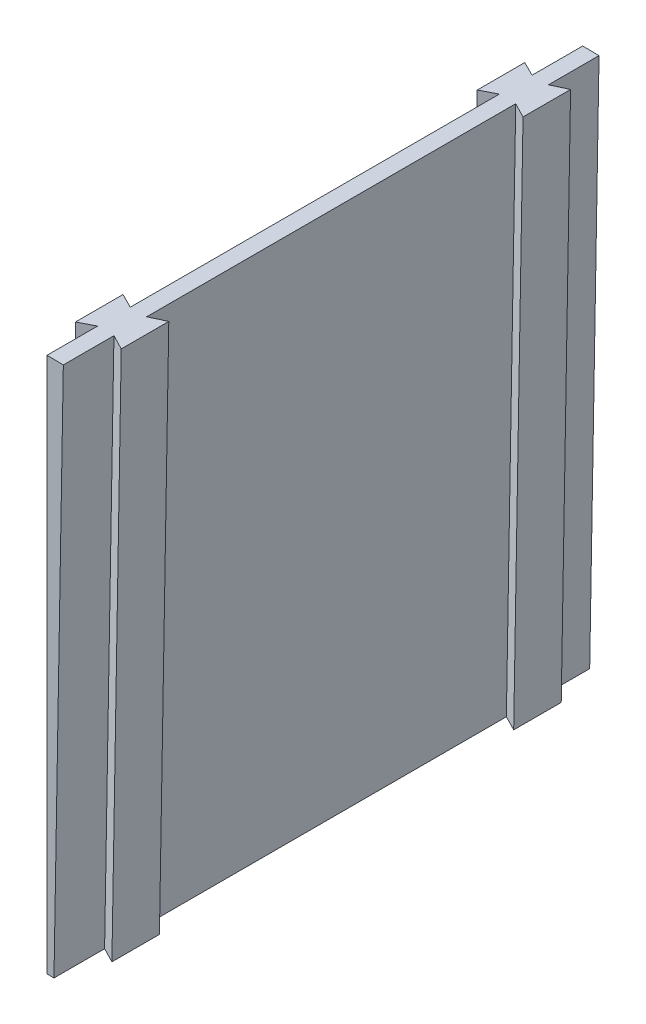
ISO-10303-21;
HEADER;
FILE_DESCRIPTION(('STEP AP214'),'2;1');
FILE_NAME('part.step','',(''),(''),'','','');
FILE_SCHEMA(('AUTOMOTIVE_DESIGN { 1 0 10303 214 1 1 1 1 }'));
ENDSEC;
DATA;
#1=APPLICATION_CONTEXT('core data for automotive mechanical design processes');
#2=APPLICATION_PROTOCOL_DEFINITION('international standard','automotive_design',2000,#1);
#3=PRODUCT_CONTEXT('',#1,'mechanical');
#4=PRODUCT('Part','Part','',(#3));
#5=PRODUCT_RELATED_PRODUCT_CATEGORY('part','',(#4));
#6=PRODUCT_DEFINITION_FORMATION('','',#4);
#7=PRODUCT_DEFINITION_CONTEXT('part definition',#1,'design');
#8=PRODUCT_DEFINITION('design','',#6,#7);
#9=PRODUCT_DEFINITION_SHAPE('','',#8);
#10=(LENGTH_UNIT() NAMED_UNIT(*) SI_UNIT(.MILLI.,.METRE.));
#11=(NAMED_UNIT(*) PLANE_ANGLE_UNIT() SI_UNIT($,.RADIAN.));
#12=(NAMED_UNIT(*) SI_UNIT($,.STERADIAN.) SOLID_ANGLE_UNIT());
#13=UNCERTAINTY_MEASURE_WITH_UNIT(LENGTH_MEASURE(1.E-05),#10,'distance_accuracy_value','');
#14=(GEOMETRIC_REPRESENTATION_CONTEXT(3) GLOBAL_UNCERTAINTY_ASSIGNED_CONTEXT((#13)) GLOBAL_UNIT_ASSIGNED_CONTEXT((#10,
#11,#12)) REPRESENTATION_CONTEXT('',''));
#15=CARTESIAN_POINT('',(0.,0.,0.));
#16=DIRECTION('',(0.,0.,1.));
#17=DIRECTION('',(1.,0.,0.));
#18=AXIS2_PLACEMENT_3D('',#15,#16,#17);
#19=CARTESIAN_POINT('',(0.,76.2,101.6));
#20=DIRECTION('',(1.,0.,0.));
#21=DIRECTION('',(0.,0.,-1.));
#22=AXIS2_PLACEMENT_3D('',#19,#20,#21);
#23=PLANE('',#22);
#24=DIRECTION('',(0.,0.,-1.));
#25=VECTOR('',#24,1.);
#26=CARTESIAN_POINT('',(0.,177.8,101.6));
#27=LINE('',#26,#25);
#28=CARTESIAN_POINT('',(0.,177.8,85.7997919351432));
#29=VERTEX_POINT('',#28);
#30=CARTESIAN_POINT('',(0.,177.8,15.8002080648568));
#31=VERTEX_POINT('',#30);
#32=EDGE_CURVE('E191',#29,#31,#27,.T.);
#33=ORIENTED_EDGE('',*,*,#32,.T.);
#34=DIRECTION('',(0.,-1.,0.));
#35=VECTOR('',#34,1.);
#36=CARTESIAN_POINT('',(0.,177.801,15.8002080648568));
#37=LINE('',#36,#35);
#38=CARTESIAN_POINT('',(0.,76.2,15.8002080648568));
#39=VERTEX_POINT('',#38);
#40=EDGE_CURVE('E68',#31,#39,#37,.T.);
#41=ORIENTED_EDGE('',*,*,#40,.T.);
#42=DIRECTION('',(0.,0.,-1.));
#43=VECTOR('',#42,1.);
#44=CARTESIAN_POINT('',(0.,76.2,101.6));
#45=LINE('',#44,#43);
#46=CARTESIAN_POINT('',(0.,76.2,85.7997919351432));
#47=VERTEX_POINT('',#46);
#48=EDGE_CURVE('E363',#47,#39,#45,.T.);
#49=ORIENTED_EDGE('',*,*,#48,.F.);
#50=DIRECTION('',(0.,-1.,0.));
#51=VECTOR('',#50,1.);
#52=CARTESIAN_POINT('',(0.,177.801,85.7997919351432));
#53=LINE('',#52,#51);
#54=EDGE_CURVE('E221',#29,#47,#53,.T.);
#55=ORIENTED_EDGE('',*,*,#54,.F.);
#56=EDGE_LOOP('',(#33,#41,#49,#55));
#57=FACE_BOUND('',#56,.T.);
#58=ADVANCED_FACE('F43',(#57),#23,.F.);
#59=CARTESIAN_POINT('',(0.,76.2,9.59979193514321));
#60=VERTEX_POINT('',#59);
#61=CARTESIAN_POINT('',(0.,76.2,0.));
#62=VERTEX_POINT('',#61);
#63=EDGE_CURVE('E60',#60,#62,#45,.T.);
#64=ORIENTED_EDGE('',*,*,#63,.F.);
#65=DIRECTION('',(0.,-1.,0.));
#66=VECTOR('',#65,1.);
#67=CARTESIAN_POINT('',(0.,177.801,9.59979193514321));
#68=LINE('',#67,#66);
#69=CARTESIAN_POINT('',(0.,177.8,9.59979193514321));
#70=VERTEX_POINT('',#69);
#71=EDGE_CURVE('E196',#70,#60,#68,.T.);
#72=ORIENTED_EDGE('',*,*,#71,.F.);
#73=CARTESIAN_POINT('',(0.,177.8,0.));
#74=VERTEX_POINT('',#73);
#75=EDGE_CURVE('E182',#70,#74,#27,.T.);
#76=ORIENTED_EDGE('',*,*,#75,.T.);
#77=DIRECTION('',(0.,-1.,0.));
#78=VECTOR('',#77,1.);
#79=CARTESIAN_POINT('',(0.,76.2,0.));
#80=LINE('',#79,#78);
#81=EDGE_CURVE('E341',#74,#62,#80,.T.);
#82=ORIENTED_EDGE('',*,*,#81,.T.);
#83=EDGE_LOOP('',(#64,#72,#76,#82));
#84=FACE_BOUND('',#83,.T.);
#85=ADVANCED_FACE('F197',(#84),#23,.F.);
#86=CARTESIAN_POINT('',(1.32987337052101,76.188394370917,101.6));
#87=DIRECTION('',(-0.999847695156391,0.0174524064372835,0.));
#88=DIRECTION('',(-0.0174524064372835,-0.999847695156391,0.));
#89=AXIS2_PLACEMENT_3D('',#86,#87,#88);
#90=PLANE('',#89);
#91=DIRECTION('',(0.,0.,-1.));
#92=VECTOR('',#91,1.);
#93=CARTESIAN_POINT('',(1.32987337052101,76.188394370917,101.6));
#94=LINE('',#93,#92);
#95=CARTESIAN_POINT('',(1.32987337052101,76.188394370917,85.7997919351432));
#96=VERTEX_POINT('',#95);
#97=CARTESIAN_POINT('',(1.32987337052101,76.1883943709171,15.8002080648568));
#98=VERTEX_POINT('',#97);
#99=EDGE_CURVE('E52',#96,#98,#94,.T.);
#100=ORIENTED_EDGE('',*,*,#99,.T.);
#101=DIRECTION('',(-0.0174524064372835,-0.999847695156391,0.));
#102=VECTOR('',#101,1.);
#103=CARTESIAN_POINT('',(3.10388874955414,177.821667368102,15.8002080648568));
#104=LINE('',#103,#102);
#105=CARTESIAN_POINT('',(3.10303786454902,177.772920198806,15.8002080648568));
#106=VERTEX_POINT('',#105);
#107=EDGE_CURVE('E258',#106,#98,#104,.T.);
#108=ORIENTED_EDGE('',*,*,#107,.F.);
#109=DIRECTION('',(0.,0.,-1.));
#110=VECTOR('',#109,1.);
#111=CARTESIAN_POINT('',(3.103037864549,177.772920198806,101.6));
#112=LINE('',#111,#110);
#113=CARTESIAN_POINT('',(3.103037864549,177.772920198806,85.7997919351432));
#114=VERTEX_POINT('',#113);
#115=EDGE_CURVE('E369',#114,#106,#112,.T.);
#116=ORIENTED_EDGE('',*,*,#115,.F.);
#117=DIRECTION('',(-0.0174524064372835,-0.999847695156391,0.));
#118=VECTOR('',#117,1.);
#119=CARTESIAN_POINT('',(3.10388874955414,177.821667368102,85.7997919351432));
#120=LINE('',#119,#118);
#121=EDGE_CURVE('E320',#114,#96,#120,.T.);
#122=ORIENTED_EDGE('',*,*,#121,.T.);
#123=EDGE_LOOP('',(#100,#108,#116,#122));
#124=FACE_BOUND('',#123,.T.);
#125=ADVANCED_FACE('F470',(#124),#90,.F.);
#126=DIRECTION('',(-0.0174524064372835,-0.999847695156391,0.));
#127=VECTOR('',#126,1.);
#128=CARTESIAN_POINT('',(3.10388874955414,177.821667368102,92.0002080648568));
#129=LINE('',#128,#127);
#130=CARTESIAN_POINT('',(3.103037864549,177.772920198806,92.0002080648568));
#131=VERTEX_POINT('',#130);
#132=CARTESIAN_POINT('',(1.32987337052101,76.1883943709171,92.0002080648568));
#133=VERTEX_POINT('',#132);
#134=EDGE_CURVE('E301',#131,#133,#129,.T.);
#135=ORIENTED_EDGE('',*,*,#134,.F.);
#136=CARTESIAN_POINT('',(3.103037864549,177.772920198806,101.6));
#137=VERTEX_POINT('',#136);
#138=EDGE_CURVE('E366',#137,#131,#112,.T.);
#139=ORIENTED_EDGE('',*,*,#138,.F.);
#140=DIRECTION('',(0.0174524064372835,0.999847695156391,0.));
#141=VECTOR('',#140,1.);
#142=CARTESIAN_POINT('',(1.32987337052101,76.188394370917,101.6));
#143=LINE('',#142,#141);
#144=CARTESIAN_POINT('',(1.32987337052101,76.188394370917,101.6));
#145=VERTEX_POINT('',#144);
#146=EDGE_CURVE('E340',#145,#137,#143,.T.);
#147=ORIENTED_EDGE('',*,*,#146,.F.);
#148=EDGE_CURVE('E11',#145,#133,#94,.T.);
#149=ORIENTED_EDGE('',*,*,#148,.T.);
#150=EDGE_LOOP('',(#135,#139,#147,#149));
#151=FACE_BOUND('',#150,.T.);
#152=ADVANCED_FACE('F449',(#151),#90,.F.);
#153=CARTESIAN_POINT('',(0.,0.,101.6));
#154=DIRECTION('',(0.,0.,-1.));
#155=DIRECTION('',(-1.,0.,0.));
#156=AXIS2_PLACEMENT_3D('',#153,#154,#155);
#157=CYLINDRICAL_SURFACE('',#156,76.2);
#158=CARTESIAN_POINT('',(0.,0.,0.));
#159=DIRECTION('',(0.,0.,-1.));
#160=DIRECTION('',(-1.,0.,0.));
#161=AXIS2_PLACEMENT_3D('',#158,#159,#160);
#162=CIRCLE('',#161,76.2);
#163=CARTESIAN_POINT('',(1.32987337052101,76.188394370917,0.));
#164=VERTEX_POINT('',#163);
#165=EDGE_CURVE('E335',#62,#164,#162,.T.);
#166=ORIENTED_EDGE('',*,*,#165,.T.);
#167=CARTESIAN_POINT('',(1.32987337052101,76.1883943709171,9.59979193514321));
#168=VERTEX_POINT('',#167);
#169=EDGE_CURVE('E53',#168,#164,#94,.T.);
#170=ORIENTED_EDGE('',*,*,#169,.F.);
#171=DIRECTION('',(0.,0.,-1.));
#172=VECTOR('',#171,1.);
#173=CARTESIAN_POINT('',(1.32987337052101,76.1883943709171,15.8002080648568));
#174=LINE('',#173,#172);
#175=EDGE_CURVE('E280',#98,#168,#174,.T.);
#176=ORIENTED_EDGE('',*,*,#175,.F.);
#177=ORIENTED_EDGE('',*,*,#99,.F.);
#178=DIRECTION('',(0.,0.,-1.));
#179=VECTOR('',#178,1.);
#180=CARTESIAN_POINT('',(1.32987337052101,76.1883943709171,85.7997919351432));
#181=LINE('',#180,#179);
#182=EDGE_CURVE('E288',#133,#96,#181,.T.);
#183=ORIENTED_EDGE('',*,*,#182,.F.);
#184=ORIENTED_EDGE('',*,*,#148,.F.);
#185=CARTESIAN_POINT('',(0.,0.,101.6));
#186=DIRECTION('',(0.,0.,-1.));
#187=DIRECTION('',(-1.,0.,0.));
#188=AXIS2_PLACEMENT_3D('',#185,#186,#187);
#189=CIRCLE('',#188,76.2);
#190=CARTESIAN_POINT('',(0.,76.2,101.6));
#191=VERTEX_POINT('',#190);
#192=EDGE_CURVE('E336',#191,#145,#189,.T.);
#193=ORIENTED_EDGE('',*,*,#192,.F.);
#194=CARTESIAN_POINT('',(0.,76.2,92.0002080648568));
#195=VERTEX_POINT('',#194);
#196=EDGE_CURVE('E192',#191,#195,#45,.T.);
#197=ORIENTED_EDGE('',*,*,#196,.T.);
#198=DIRECTION('',(0.,0.,1.));
#199=VECTOR('',#198,1.);
#200=CARTESIAN_POINT('',(0.,76.2,85.7997919351432));
#201=LINE('',#200,#199);
#202=EDGE_CURVE('E225',#47,#195,#201,.T.);
#203=ORIENTED_EDGE('',*,*,#202,.F.);
#204=ORIENTED_EDGE('',*,*,#48,.T.);
#205=DIRECTION('',(0.,0.,1.));
#206=VECTOR('',#205,1.);
#207=CARTESIAN_POINT('',(0.,76.2,15.8002080648568));
#208=LINE('',#207,#206);
#209=EDGE_CURVE('E389',#60,#39,#208,.T.);
#210=ORIENTED_EDGE('',*,*,#209,.F.);
#211=ORIENTED_EDGE('',*,*,#63,.T.);
#212=EDGE_LOOP('',(#166,#170,#176,#177,#183,#184,#193,#197,#203,#204,#210,#211));
#213=FACE_BOUND('',#212,.T.);
#214=ADVANCED_FACE('F45',(#213),#157,.F.);
#215=CARTESIAN_POINT('',(3.103037864549,177.772920198806,9.59979193514321));
#216=VERTEX_POINT('',#215);
#217=CARTESIAN_POINT('',(3.103037864549,177.772920198806,0.));
#218=VERTEX_POINT('',#217);
#219=EDGE_CURVE('E365',#216,#218,#112,.T.);
#220=ORIENTED_EDGE('',*,*,#219,.F.);
#221=DIRECTION('',(-0.0174524064372835,-0.999847695156391,0.));
#222=VECTOR('',#221,1.);
#223=CARTESIAN_POINT('',(3.10388874955414,177.821667368102,9.59979193514321));
#224=LINE('',#223,#222);
#225=EDGE_CURVE('E262',#216,#168,#224,.T.);
#226=ORIENTED_EDGE('',*,*,#225,.T.);
#227=ORIENTED_EDGE('',*,*,#169,.T.);
#228=DIRECTION('',(0.0174524064372835,0.999847695156391,0.));
#229=VECTOR('',#228,1.);
#230=CARTESIAN_POINT('',(1.32987337052101,76.188394370917,0.));
#231=LINE('',#230,#229);
#232=EDGE_CURVE('E353',#164,#218,#231,.T.);
#233=ORIENTED_EDGE('',*,*,#232,.T.);
#234=EDGE_LOOP('',(#220,#226,#227,#233));
#235=FACE_BOUND('',#234,.T.);
#236=ADVANCED_FACE('F381',(#235),#90,.F.);
#237=CARTESIAN_POINT('',(0.,0.,101.6));
#238=DIRECTION('',(0.,0.,-1.));
#239=DIRECTION('',(-1.,0.,0.));
#240=AXIS2_PLACEMENT_3D('',#237,#238,#239);
#241=CYLINDRICAL_SURFACE('',#240,177.8);
#242=CARTESIAN_POINT('',(0.,0.,0.));
#243=DIRECTION('',(0.,0.,1.));
#244=DIRECTION('',(-1.,0.,0.));
#245=AXIS2_PLACEMENT_3D('',#242,#243,#244);
#246=CIRCLE('',#245,177.8);
#247=EDGE_CURVE('E188',#218,#74,#246,.T.);
#248=ORIENTED_EDGE('',*,*,#247,.T.);
#249=ORIENTED_EDGE('',*,*,#75,.F.);
#250=CARTESIAN_POINT('',(0.,0.,9.59979193514321));
#251=DIRECTION('',(0.450153111117083,0.,-0.892951385323754));
#252=DIRECTION('',(-0.892951385323754,0.,-0.450153111117083));
#253=AXIS2_PLACEMENT_3D('',#250,#251,#252);
#254=ELLIPSE('',#253,199.114983102396,177.8);
#255=CARTESIAN_POINT('',(-2.79357446026696,177.778052474806,8.1915));
#256=VERTEX_POINT('',#255);
#257=EDGE_CURVE('E185',#70,#256,#254,.F.);
#258=ORIENTED_EDGE('',*,*,#257,.T.);
#259=DIRECTION('',(0.,0.,-1.));
#260=VECTOR('',#259,1.);
#261=CARTESIAN_POINT('',(-2.79357446026696,177.778052474806,101.6));
#262=LINE('',#261,#260);
#263=CARTESIAN_POINT('',(-2.79357446026696,177.778052474806,17.2085));
#264=VERTEX_POINT('',#263);
#265=EDGE_CURVE('E213',#256,#264,#262,.F.);
#266=ORIENTED_EDGE('',*,*,#265,.T.);
#267=CARTESIAN_POINT('',(0.,0.,15.8002080648568));
#268=DIRECTION('',(0.450153111117083,0.,0.892951385323754));
#269=DIRECTION('',(0.892951385323754,0.,-0.450153111117083));
#270=AXIS2_PLACEMENT_3D('',#267,#268,#269);
#271=ELLIPSE('',#270,199.114983102396,177.8);
#272=EDGE_CURVE('E207',#264,#31,#271,.F.);
#273=ORIENTED_EDGE('',*,*,#272,.T.);
#274=ORIENTED_EDGE('',*,*,#32,.F.);
#275=CARTESIAN_POINT('',(0.,0.,85.7997919351432));
#276=DIRECTION('',(0.450153111117083,0.,-0.892951385323754));
#277=DIRECTION('',(-0.892951385323754,0.,-0.450153111117083));
#278=AXIS2_PLACEMENT_3D('',#275,#276,#277);
#279=ELLIPSE('',#278,199.114983102396,177.8);
#280=CARTESIAN_POINT('',(-2.79357446026696,177.778052474806,84.3915));
#281=VERTEX_POINT('',#280);
#282=EDGE_CURVE('E220',#29,#281,#279,.F.);
#283=ORIENTED_EDGE('',*,*,#282,.T.);
#284=DIRECTION('',(0.,0.,-1.));
#285=VECTOR('',#284,1.);
#286=CARTESIAN_POINT('',(-2.79357446026696,177.778052474806,101.6));
#287=LINE('',#286,#285);
#288=CARTESIAN_POINT('',(-2.79357446026696,177.778052474806,93.4085));
#289=VERTEX_POINT('',#288);
#290=EDGE_CURVE('E217',#281,#289,#287,.F.);
#291=ORIENTED_EDGE('',*,*,#290,.T.);
#292=CARTESIAN_POINT('',(0.,0.,92.0002080648568));
#293=DIRECTION('',(0.450153111117083,0.,0.892951385323754));
#294=DIRECTION('',(0.892951385323754,0.,-0.450153111117083));
#295=AXIS2_PLACEMENT_3D('',#292,#293,#294);
#296=ELLIPSE('',#295,199.114983102396,177.8);
#297=CARTESIAN_POINT('',(0.,177.8,92.0002080648568));
#298=VERTEX_POINT('',#297);
#299=EDGE_CURVE('E224',#289,#298,#296,.F.);
#300=ORIENTED_EDGE('',*,*,#299,.T.);
#301=CARTESIAN_POINT('',(0.,177.8,101.6));
#302=VERTEX_POINT('',#301);
#303=EDGE_CURVE('E194',#302,#298,#27,.T.);
#304=ORIENTED_EDGE('',*,*,#303,.F.);
#305=CARTESIAN_POINT('',(0.,0.,101.6));
#306=DIRECTION('',(0.,0.,1.));
#307=DIRECTION('',(-1.,0.,0.));
#308=AXIS2_PLACEMENT_3D('',#305,#306,#307);
#309=CIRCLE('',#308,177.8);
#310=EDGE_CURVE('E344',#137,#302,#309,.T.);
#311=ORIENTED_EDGE('',*,*,#310,.F.);
#312=ORIENTED_EDGE('',*,*,#138,.T.);
#313=CARTESIAN_POINT('',(0.,0.,92.0002080648568));
#314=DIRECTION('',(-0.450029888864768,0.00785530092977308,0.892978943411135));
#315=DIRECTION('',(-0.892842938392813,0.0155846314603472,-0.450098441037438));
#316=AXIS2_PLACEMENT_3D('',#313,#314,#315);
#317=ELLIPSE('',#316,199.108838245181,177.8);
#318=CARTESIAN_POINT('',(5.89622917097531,177.70220730639,93.4085));
#319=VERTEX_POINT('',#318);
#320=EDGE_CURVE('E300',#131,#319,#317,.F.);
#321=ORIENTED_EDGE('',*,*,#320,.T.);
#322=DIRECTION('',(0.,0.,-1.));
#323=VECTOR('',#322,1.);
#324=CARTESIAN_POINT('',(5.89622917097531,177.70220730639,101.6));
#325=LINE('',#324,#323);
#326=CARTESIAN_POINT('',(5.89622917097531,177.70220730639,84.3915));
#327=VERTEX_POINT('',#326);
#328=EDGE_CURVE('E297',#319,#327,#325,.T.);
#329=ORIENTED_EDGE('',*,*,#328,.T.);
#330=CARTESIAN_POINT('',(0.,0.,85.7997919351432));
#331=DIRECTION('',(-0.450029888864768,0.00785530092977308,-0.892978943411135));
#332=DIRECTION('',(0.892842938392813,-0.0155846314603472,-0.450098441037439));
#333=AXIS2_PLACEMENT_3D('',#330,#331,#332);
#334=ELLIPSE('',#333,199.108838245181,177.8);
#335=EDGE_CURVE('E304',#327,#114,#334,.F.);
#336=ORIENTED_EDGE('',*,*,#335,.T.);
#337=ORIENTED_EDGE('',*,*,#115,.T.);
#338=CARTESIAN_POINT('',(0.,0.,15.8002080648568));
#339=DIRECTION('',(-0.450029888864768,0.00785530092977308,0.892978943411135));
#340=DIRECTION('',(-0.892842938392813,0.0155846314603472,-0.450098441037439));
#341=AXIS2_PLACEMENT_3D('',#338,#339,#340);
#342=ELLIPSE('',#341,199.108838245181,177.8);
#343=CARTESIAN_POINT('',(5.89622917097531,177.70220730639,17.2085));
#344=VERTEX_POINT('',#343);
#345=EDGE_CURVE('E257',#106,#344,#342,.F.);
#346=ORIENTED_EDGE('',*,*,#345,.T.);
#347=DIRECTION('',(0.,0.,-1.));
#348=VECTOR('',#347,1.);
#349=CARTESIAN_POINT('',(5.89622917097531,177.70220730639,101.6));
#350=LINE('',#349,#348);
#351=CARTESIAN_POINT('',(5.89622917097531,177.70220730639,8.1915));
#352=VERTEX_POINT('',#351);
#353=EDGE_CURVE('E291',#344,#352,#350,.T.);
#354=ORIENTED_EDGE('',*,*,#353,.T.);
#355=CARTESIAN_POINT('',(0.,0.,9.59979193514321));
#356=DIRECTION('',(-0.450029888864768,0.00785530092977308,-0.892978943411135));
#357=DIRECTION('',(0.892842938392813,-0.0155846314603472,-0.450098441037438));
#358=AXIS2_PLACEMENT_3D('',#355,#356,#357);
#359=ELLIPSE('',#358,199.108838245181,177.8);
#360=EDGE_CURVE('E272',#352,#216,#359,.F.);
#361=ORIENTED_EDGE('',*,*,#360,.T.);
#362=ORIENTED_EDGE('',*,*,#219,.T.);
#363=EDGE_LOOP('',(#248,#249,#258,#266,#273,#274,#283,#291,#300,#304,#311,#312,#321,#329,#336,
#337,#346,#354,#361,#362));
#364=FACE_BOUND('',#363,.T.);
#365=ADVANCED_FACE('F183',(#364),#241,.T.);
#366=ORIENTED_EDGE('',*,*,#303,.T.);
#367=DIRECTION('',(0.,-1.,0.));
#368=VECTOR('',#367,1.);
#369=CARTESIAN_POINT('',(0.,177.801,92.0002080648568));
#370=LINE('',#369,#368);
#371=EDGE_CURVE('E242',#298,#195,#370,.T.);
#372=ORIENTED_EDGE('',*,*,#371,.T.);
#373=ORIENTED_EDGE('',*,*,#196,.F.);
#374=DIRECTION('',(0.,-1.,0.));
#375=VECTOR('',#374,1.);
#376=CARTESIAN_POINT('',(0.,76.2,101.6));
#377=LINE('',#376,#375);
#378=EDGE_CURVE('E347',#302,#191,#377,.T.);
#379=ORIENTED_EDGE('',*,*,#378,.F.);
#380=EDGE_LOOP('',(#366,#372,#373,#379));
#381=FACE_BOUND('',#380,.T.);
#382=ADVANCED_FACE('F443',(#381),#23,.F.);
#383=CARTESIAN_POINT('',(0.,0.,101.6));
#384=DIRECTION('',(0.,0.,-1.));
#385=DIRECTION('',(-1.,0.,0.));
#386=AXIS2_PLACEMENT_3D('',#383,#384,#385);
#387=PLANE('',#386);
#388=ORIENTED_EDGE('',*,*,#192,.T.);
#389=ORIENTED_EDGE('',*,*,#146,.T.);
#390=ORIENTED_EDGE('',*,*,#310,.T.);
#391=ORIENTED_EDGE('',*,*,#378,.T.);
#392=EDGE_LOOP('',(#388,#389,#390,#391));
#393=FACE_BOUND('',#392,.T.);
#394=ADVANCED_FACE('F446',(#393),#387,.F.);
#395=CARTESIAN_POINT('',(0.,0.,0.));
#396=DIRECTION('',(0.,0.,-1.));
#397=DIRECTION('',(-1.,0.,0.));
#398=AXIS2_PLACEMENT_3D('',#395,#396,#397);
#399=PLANE('',#398);
#400=ORIENTED_EDGE('',*,*,#165,.F.);
#401=ORIENTED_EDGE('',*,*,#81,.F.);
#402=ORIENTED_EDGE('',*,*,#247,.F.);
#403=ORIENTED_EDGE('',*,*,#232,.F.);
#404=EDGE_LOOP('',(#400,#401,#402,#403));
#405=FACE_BOUND('',#404,.T.);
#406=ADVANCED_FACE('F385',(#405),#399,.T.);
#407=CARTESIAN_POINT('',(3.10388874955414,177.821667368102,92.0002080648568));
#408=DIRECTION('',(-0.450029888864768,0.00785530092977308,0.892978943411135));
#409=DIRECTION('',(0.893006495655164,0.,0.45004377422389));
#410=AXIS2_PLACEMENT_3D('',#407,#408,#409);
#411=PLANE('',#410);
#412=ORIENTED_EDGE('',*,*,#320,.F.);
#413=ORIENTED_EDGE('',*,*,#134,.T.);
#414=DIRECTION('',(-0.892842938392813,0.0155846314603458,-0.450098441037438));
#415=VECTOR('',#414,1.);
#416=CARTESIAN_POINT('',(1.32987337052101,76.1883943709171,92.0002080648568));
#417=LINE('',#416,#415);
#418=CARTESIAN_POINT('',(4.12344783078796,76.1396323473313,93.4085));
#419=VERTEX_POINT('',#418);
#420=EDGE_CURVE('E316',#419,#133,#417,.T.);
#421=ORIENTED_EDGE('',*,*,#420,.F.);
#422=DIRECTION('',(-0.0174524064372835,-0.999847695156391,0.));
#423=VECTOR('',#422,1.);
#424=CARTESIAN_POINT('',(5.8974632098211,177.772905344516,93.4085));
#425=LINE('',#424,#423);
#426=EDGE_CURVE('E324',#319,#419,#425,.T.);
#427=ORIENTED_EDGE('',*,*,#426,.F.);
#428=EDGE_LOOP('',(#412,#413,#421,#427));
#429=FACE_BOUND('',#428,.T.);
#430=ADVANCED_FACE('F453',(#429),#411,.T.);
#431=CARTESIAN_POINT('',(5.8974632098211,177.772905344516,84.3915));
#432=DIRECTION('',(-0.450029888864768,0.00785530092977308,-0.892978943411135));
#433=DIRECTION('',(-0.893006495655164,0.,0.45004377422389));
#434=AXIS2_PLACEMENT_3D('',#431,#432,#433);
#435=PLANE('',#434);
#436=ORIENTED_EDGE('',*,*,#335,.F.);
#437=DIRECTION('',(-0.0174524064372835,-0.999847695156391,0.));
#438=VECTOR('',#437,1.);
#439=CARTESIAN_POINT('',(5.8974632098211,177.772905344516,84.3915));
#440=LINE('',#439,#438);
#441=CARTESIAN_POINT('',(4.12344783078796,76.1396323473313,84.3915));
#442=VERTEX_POINT('',#441);
#443=EDGE_CURVE('E327',#327,#442,#440,.T.);
#444=ORIENTED_EDGE('',*,*,#443,.T.);
#445=DIRECTION('',(0.892842938392813,-0.0155846314603458,-0.450098441037438));
#446=VECTOR('',#445,1.);
#447=CARTESIAN_POINT('',(4.12344783078796,76.1396323473313,84.3915));
#448=LINE('',#447,#446);
#449=EDGE_CURVE('E308',#96,#442,#448,.T.);
#450=ORIENTED_EDGE('',*,*,#449,.F.);
#451=ORIENTED_EDGE('',*,*,#121,.F.);
#452=EDGE_LOOP('',(#436,#444,#450,#451));
#453=FACE_BOUND('',#452,.T.);
#454=ADVANCED_FACE('F466',(#453),#435,.T.);
#455=CARTESIAN_POINT('',(5.8974632098211,177.772905344516,93.4085));
#456=DIRECTION('',(0.999847695156391,-0.0174524064372835,0.));
#457=DIRECTION('',(0.0174524064372835,0.999847695156391,0.));
#458=AXIS2_PLACEMENT_3D('',#455,#456,#457);
#459=PLANE('',#458);
#460=ORIENTED_EDGE('',*,*,#328,.F.);
#461=ORIENTED_EDGE('',*,*,#426,.T.);
#462=DIRECTION('',(0.,0.,1.));
#463=VECTOR('',#462,1.);
#464=CARTESIAN_POINT('',(4.12344783078796,76.1396323473313,93.4085));
#465=LINE('',#464,#463);
#466=EDGE_CURVE('E312',#442,#419,#465,.T.);
#467=ORIENTED_EDGE('',*,*,#466,.F.);
#468=ORIENTED_EDGE('',*,*,#443,.F.);
#469=EDGE_LOOP('',(#460,#461,#467,#468));
#470=FACE_BOUND('',#469,.T.);
#471=ADVANCED_FACE('F462',(#470),#459,.T.);
#472=CARTESIAN_POINT('',(1.32987337052089,76.1883943709171,0.));
#473=DIRECTION('',(0.0174524064372821,0.999847695156391,0.));
#474=DIRECTION('',(-0.999847695156391,0.0174524064372821,0.));
#475=AXIS2_PLACEMENT_3D('',#472,#473,#474);
#476=PLANE('',#475);
#477=ORIENTED_EDGE('',*,*,#182,.T.);
#478=ORIENTED_EDGE('',*,*,#449,.T.);
#479=ORIENTED_EDGE('',*,*,#466,.T.);
#480=ORIENTED_EDGE('',*,*,#420,.T.);
#481=EDGE_LOOP('',(#477,#478,#479,#480));
#482=FACE_BOUND('',#481,.T.);
#483=ADVANCED_FACE('F456',(#482),#476,.F.);
#484=CARTESIAN_POINT('',(5.8974632098211,177.772905344516,17.2085));
#485=DIRECTION('',(-0.450029888864768,0.00785530092977308,0.892978943411135));
#486=DIRECTION('',(0.893006495655164,0.,0.45004377422389));
#487=AXIS2_PLACEMENT_3D('',#484,#485,#486);
#488=PLANE('',#487);
#489=ORIENTED_EDGE('',*,*,#345,.F.);
#490=ORIENTED_EDGE('',*,*,#107,.T.);
#491=DIRECTION('',(-0.892842938392813,0.0155846314603458,-0.450098441037438));
#492=VECTOR('',#491,1.);
#493=CARTESIAN_POINT('',(4.12344783078796,76.1396323473313,17.2085));
#494=LINE('',#493,#492);
#495=CARTESIAN_POINT('',(4.12344783078796,76.1396323473313,17.2085));
#496=VERTEX_POINT('',#495);
#497=EDGE_CURVE('E284',#496,#98,#494,.T.);
#498=ORIENTED_EDGE('',*,*,#497,.F.);
#499=DIRECTION('',(-0.0174524064372835,-0.999847695156391,0.));
#500=VECTOR('',#499,1.);
#501=CARTESIAN_POINT('',(5.8974632098211,177.772905344516,17.2085));
#502=LINE('',#501,#500);
#503=EDGE_CURVE('E269',#344,#496,#502,.T.);
#504=ORIENTED_EDGE('',*,*,#503,.F.);
#505=EDGE_LOOP('',(#489,#490,#498,#504));
#506=FACE_BOUND('',#505,.T.);
#507=ADVANCED_FACE('F485',(#506),#488,.T.);
#508=CARTESIAN_POINT('',(3.10388874955414,177.821667368102,9.59979193514321));
#509=DIRECTION('',(-0.450029888864768,0.00785530092977308,-0.892978943411135));
#510=DIRECTION('',(-0.893006495655164,0.,0.45004377422389));
#511=AXIS2_PLACEMENT_3D('',#508,#509,#510);
#512=PLANE('',#511);
#513=ORIENTED_EDGE('',*,*,#360,.F.);
#514=DIRECTION('',(-0.0174524064372835,-0.999847695156391,0.));
#515=VECTOR('',#514,1.);
#516=CARTESIAN_POINT('',(5.8974632098211,177.772905344516,8.1915));
#517=LINE('',#516,#515);
#518=CARTESIAN_POINT('',(4.12344783078796,76.1396323473313,8.1915));
#519=VERTEX_POINT('',#518);
#520=EDGE_CURVE('E266',#352,#519,#517,.T.);
#521=ORIENTED_EDGE('',*,*,#520,.T.);
#522=DIRECTION('',(0.892842938392813,-0.0155846314603458,-0.450098441037438));
#523=VECTOR('',#522,1.);
#524=CARTESIAN_POINT('',(1.32987337052101,76.1883943709171,9.59979193514321));
#525=LINE('',#524,#523);
#526=EDGE_CURVE('E276',#168,#519,#525,.T.);
#527=ORIENTED_EDGE('',*,*,#526,.F.);
#528=ORIENTED_EDGE('',*,*,#225,.F.);
#529=EDGE_LOOP('',(#513,#521,#527,#528));
#530=FACE_BOUND('',#529,.T.);
#531=ADVANCED_FACE('F478',(#530),#512,.T.);
#532=CARTESIAN_POINT('',(5.8974632098211,177.772905344516,8.1915));
#533=DIRECTION('',(0.999847695156391,-0.0174524064372835,0.));
#534=DIRECTION('',(0.0174524064372835,0.999847695156391,0.));
#535=AXIS2_PLACEMENT_3D('',#532,#533,#534);
#536=PLANE('',#535);
#537=ORIENTED_EDGE('',*,*,#353,.F.);
#538=ORIENTED_EDGE('',*,*,#503,.T.);
#539=DIRECTION('',(0.,0.,1.));
#540=VECTOR('',#539,1.);
#541=CARTESIAN_POINT('',(4.12344783078796,76.1396323473313,8.1915));
#542=LINE('',#541,#540);
#543=EDGE_CURVE('E261',#519,#496,#542,.T.);
#544=ORIENTED_EDGE('',*,*,#543,.F.);
#545=ORIENTED_EDGE('',*,*,#520,.F.);
#546=EDGE_LOOP('',(#537,#538,#544,#545));
#547=FACE_BOUND('',#546,.T.);
#548=ADVANCED_FACE('F482',(#547),#536,.T.);
#549=CARTESIAN_POINT('',(1.3298733705209,76.1883943709171,0.));
#550=DIRECTION('',(-0.0174524064372821,-0.999847695156391,0.));
#551=DIRECTION('',(0.999847695156391,-0.0174524064372821,0.));
#552=AXIS2_PLACEMENT_3D('',#549,#550,#551);
#553=PLANE('',#552);
#554=ORIENTED_EDGE('',*,*,#497,.T.);
#555=ORIENTED_EDGE('',*,*,#175,.T.);
#556=ORIENTED_EDGE('',*,*,#526,.T.);
#557=ORIENTED_EDGE('',*,*,#543,.T.);
#558=EDGE_LOOP('',(#554,#555,#556,#557));
#559=FACE_BOUND('',#558,.T.);
#560=ADVANCED_FACE('F474',(#559),#553,.T.);
#561=CARTESIAN_POINT('',(-2.79357446026696,177.801,84.3915));
#562=DIRECTION('',(0.450153111117083,0.,-0.892951385323754));
#563=DIRECTION('',(-0.892951385323754,0.,-0.450153111117083));
#564=AXIS2_PLACEMENT_3D('',#561,#562,#563);
#565=PLANE('',#564);
#566=ORIENTED_EDGE('',*,*,#282,.F.);
#567=ORIENTED_EDGE('',*,*,#54,.T.);
#568=DIRECTION('',(0.892951385323754,0.,0.450153111117083));
#569=VECTOR('',#568,1.);
#570=CARTESIAN_POINT('',(-2.79357446026696,76.2,84.3915));
#571=LINE('',#570,#569);
#572=CARTESIAN_POINT('',(-2.79357446026696,76.2,84.3915));
#573=VERTEX_POINT('',#572);
#574=EDGE_CURVE('E238',#573,#47,#571,.T.);
#575=ORIENTED_EDGE('',*,*,#574,.F.);
#576=DIRECTION('',(0.,-1.,0.));
#577=VECTOR('',#576,1.);
#578=CARTESIAN_POINT('',(-2.79357446026696,177.801,84.3915));
#579=LINE('',#578,#577);
#580=EDGE_CURVE('E246',#281,#573,#579,.T.);
#581=ORIENTED_EDGE('',*,*,#580,.F.);
#582=EDGE_LOOP('',(#566,#567,#575,#581));
#583=FACE_BOUND('',#582,.T.);
#584=ADVANCED_FACE('F426',(#583),#565,.T.);
#585=CARTESIAN_POINT('',(0.,177.801,92.0002080648568));
#586=DIRECTION('',(0.450153111117083,0.,0.892951385323754));
#587=DIRECTION('',(0.892951385323754,0.,-0.450153111117083));
#588=AXIS2_PLACEMENT_3D('',#585,#586,#587);
#589=PLANE('',#588);
#590=ORIENTED_EDGE('',*,*,#299,.F.);
#591=DIRECTION('',(0.,-1.,0.));
#592=VECTOR('',#591,1.);
#593=CARTESIAN_POINT('',(-2.79357446026696,177.801,93.4085));
#594=LINE('',#593,#592);
#595=CARTESIAN_POINT('',(-2.79357446026696,76.2,93.4085));
#596=VERTEX_POINT('',#595);
#597=EDGE_CURVE('E249',#289,#596,#594,.T.);
#598=ORIENTED_EDGE('',*,*,#597,.T.);
#599=DIRECTION('',(-0.892951385323754,0.,0.450153111117083));
#600=VECTOR('',#599,1.);
#601=CARTESIAN_POINT('',(0.,76.2,92.0002080648568));
#602=LINE('',#601,#600);
#603=EDGE_CURVE('E229',#195,#596,#602,.T.);
#604=ORIENTED_EDGE('',*,*,#603,.F.);
#605=ORIENTED_EDGE('',*,*,#371,.F.);
#606=EDGE_LOOP('',(#590,#598,#604,#605));
#607=FACE_BOUND('',#606,.T.);
#608=ADVANCED_FACE('F438',(#607),#589,.T.);
#609=CARTESIAN_POINT('',(-2.79357446026696,177.801,93.4085));
#610=DIRECTION('',(-1.,0.,0.));
#611=DIRECTION('',(0.,0.,1.));
#612=AXIS2_PLACEMENT_3D('',#609,#610,#611);
#613=PLANE('',#612);
#614=ORIENTED_EDGE('',*,*,#290,.F.);
#615=ORIENTED_EDGE('',*,*,#580,.T.);
#616=DIRECTION('',(0.,0.,-1.));
#617=VECTOR('',#616,1.);
#618=CARTESIAN_POINT('',(-2.79357446026696,76.2,93.4085));
#619=LINE('',#618,#617);
#620=EDGE_CURVE('E234',#596,#573,#619,.T.);
#621=ORIENTED_EDGE('',*,*,#620,.F.);
#622=ORIENTED_EDGE('',*,*,#597,.F.);
#623=EDGE_LOOP('',(#614,#615,#621,#622));
#624=FACE_BOUND('',#623,.T.);
#625=ADVANCED_FACE('F430',(#624),#613,.T.);
#626=CARTESIAN_POINT('',(0.,76.2,0.));
#627=DIRECTION('',(0.,-1.,0.));
#628=DIRECTION('',(0.,0.,-1.));
#629=AXIS2_PLACEMENT_3D('',#626,#627,#628);
#630=PLANE('',#629);
#631=ORIENTED_EDGE('',*,*,#202,.T.);
#632=ORIENTED_EDGE('',*,*,#603,.T.);
#633=ORIENTED_EDGE('',*,*,#620,.T.);
#634=ORIENTED_EDGE('',*,*,#574,.T.);
#635=EDGE_LOOP('',(#631,#632,#633,#634));
#636=FACE_BOUND('',#635,.T.);
#637=ADVANCED_FACE('F433',(#636),#630,.T.);
#638=CARTESIAN_POINT('',(-2.79357446026696,177.801,17.2085));
#639=DIRECTION('',(0.450153111117083,0.,0.892951385323754));
#640=DIRECTION('',(0.892951385323754,0.,-0.450153111117083));
#641=AXIS2_PLACEMENT_3D('',#638,#639,#640);
#642=PLANE('',#641);
#643=ORIENTED_EDGE('',*,*,#272,.F.);
#644=DIRECTION('',(0.,-1.,0.));
#645=VECTOR('',#644,1.);
#646=CARTESIAN_POINT('',(-2.79357446026696,177.801,17.2085));
#647=LINE('',#646,#645);
#648=CARTESIAN_POINT('',(-2.79357446026696,76.2,17.2085));
#649=VERTEX_POINT('',#648);
#650=EDGE_CURVE('E398',#264,#649,#647,.T.);
#651=ORIENTED_EDGE('',*,*,#650,.T.);
#652=DIRECTION('',(-0.892951385323754,0.,0.450153111117083));
#653=VECTOR('',#652,1.);
#654=CARTESIAN_POINT('',(-2.79357446026696,76.2,17.2085));
#655=LINE('',#654,#653);
#656=EDGE_CURVE('E230',#39,#649,#655,.T.);
#657=ORIENTED_EDGE('',*,*,#656,.F.);
#658=ORIENTED_EDGE('',*,*,#40,.F.);
#659=EDGE_LOOP('',(#643,#651,#657,#658));
#660=FACE_BOUND('',#659,.T.);
#661=ADVANCED_FACE('F396',(#660),#642,.T.);
#662=CARTESIAN_POINT('',(0.,177.801,9.59979193514321));
#663=DIRECTION('',(0.450153111117083,0.,-0.892951385323754));
#664=DIRECTION('',(-0.892951385323754,0.,-0.450153111117083));
#665=AXIS2_PLACEMENT_3D('',#662,#663,#664);
#666=PLANE('',#665);
#667=ORIENTED_EDGE('',*,*,#257,.F.);
#668=ORIENTED_EDGE('',*,*,#71,.T.);
#669=DIRECTION('',(0.892951385323754,0.,0.450153111117083));
#670=VECTOR('',#669,1.);
#671=CARTESIAN_POINT('',(0.,76.2,9.59979193514321));
#672=LINE('',#671,#670);
#673=CARTESIAN_POINT('',(-2.79357446026696,76.2,8.1915));
#674=VERTEX_POINT('',#673);
#675=EDGE_CURVE('E405',#674,#60,#672,.T.);
#676=ORIENTED_EDGE('',*,*,#675,.F.);
#677=DIRECTION('',(0.,-1.,0.));
#678=VECTOR('',#677,1.);
#679=CARTESIAN_POINT('',(-2.79357446026696,177.801,8.1915));
#680=LINE('',#679,#678);
#681=EDGE_CURVE('E202',#256,#674,#680,.T.);
#682=ORIENTED_EDGE('',*,*,#681,.F.);
#683=EDGE_LOOP('',(#667,#668,#676,#682));
#684=FACE_BOUND('',#683,.T.);
#685=ADVANCED_FACE('F204',(#684),#666,.T.);
#686=CARTESIAN_POINT('',(-2.79357446026696,177.801,8.1915));
#687=DIRECTION('',(-1.,0.,0.));
#688=DIRECTION('',(0.,0.,1.));
#689=AXIS2_PLACEMENT_3D('',#686,#687,#688);
#690=PLANE('',#689);
#691=ORIENTED_EDGE('',*,*,#265,.F.);
#692=ORIENTED_EDGE('',*,*,#681,.T.);
#693=DIRECTION('',(0.,0.,-1.));
#694=VECTOR('',#693,1.);
#695=CARTESIAN_POINT('',(-2.79357446026696,76.2,8.1915));
#696=LINE('',#695,#694);
#697=EDGE_CURVE('E403',#649,#674,#696,.T.);
#698=ORIENTED_EDGE('',*,*,#697,.F.);
#699=ORIENTED_EDGE('',*,*,#650,.F.);
#700=EDGE_LOOP('',(#691,#692,#698,#699));
#701=FACE_BOUND('',#700,.T.);
#702=ADVANCED_FACE('F415',(#701),#690,.T.);
#703=CARTESIAN_POINT('',(0.,76.2,0.));
#704=DIRECTION('',(0.,1.,0.));
#705=DIRECTION('',(0.,0.,1.));
#706=AXIS2_PLACEMENT_3D('',#703,#704,#705);
#707=PLANE('',#706);
#708=ORIENTED_EDGE('',*,*,#656,.T.);
#709=ORIENTED_EDGE('',*,*,#697,.T.);
#710=ORIENTED_EDGE('',*,*,#675,.T.);
#711=ORIENTED_EDGE('',*,*,#209,.T.);
#712=EDGE_LOOP('',(#708,#709,#710,#711));
#713=FACE_BOUND('',#712,.T.);
#714=ADVANCED_FACE('F404',(#713),#707,.F.);
#715=CLOSED_SHELL('',(#58,#85,#125,#152,#214,#236,#365,#382,#394,#406,#430,#454,#471,#483,#507,
#531,#548,#560,#584,#608,#625,#637,#661,#685,#702,#714));
#716=MANIFOLD_SOLID_BREP('B2',#715);
#717=ADVANCED_BREP_SHAPE_REPRESENTATION('',(#18,#716),#14);
#718=SHAPE_DEFINITION_REPRESENTATION(#9,#717);
ENDSEC;
END-ISO-10303-21;
